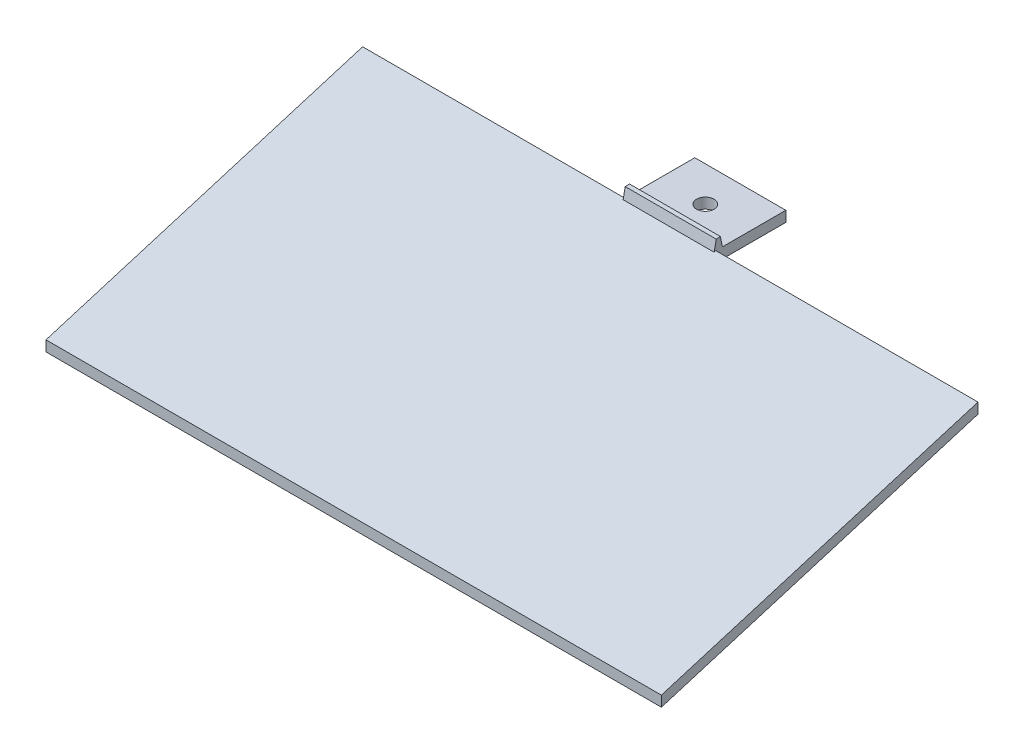
ISO-10303-21;
HEADER;
FILE_DESCRIPTION(('STEP AP214'),'2;1');
FILE_NAME('part.step','',(''),(''),'','','');
FILE_SCHEMA(('AUTOMOTIVE_DESIGN { 1 0 10303 214 1 1 1 1 }'));
ENDSEC;
DATA;
#1=APPLICATION_CONTEXT('core data for automotive mechanical design processes');
#2=APPLICATION_PROTOCOL_DEFINITION('international standard','automotive_design',2000,#1);
#3=PRODUCT_CONTEXT('',#1,'mechanical');
#4=PRODUCT('Part','Part','',(#3));
#5=PRODUCT_RELATED_PRODUCT_CATEGORY('part','',(#4));
#6=PRODUCT_DEFINITION_FORMATION('','',#4);
#7=PRODUCT_DEFINITION_CONTEXT('part definition',#1,'design');
#8=PRODUCT_DEFINITION('design','',#6,#7);
#9=PRODUCT_DEFINITION_SHAPE('','',#8);
#10=(LENGTH_UNIT() NAMED_UNIT(*) SI_UNIT(.MILLI.,.METRE.));
#11=(NAMED_UNIT(*) PLANE_ANGLE_UNIT() SI_UNIT($,.RADIAN.));
#12=(NAMED_UNIT(*) SI_UNIT($,.STERADIAN.) SOLID_ANGLE_UNIT());
#13=UNCERTAINTY_MEASURE_WITH_UNIT(LENGTH_MEASURE(1.E-05),#10,'distance_accuracy_value','');
#14=(GEOMETRIC_REPRESENTATION_CONTEXT(3) GLOBAL_UNCERTAINTY_ASSIGNED_CONTEXT((#13)) GLOBAL_UNIT_ASSIGNED_CONTEXT((#10,
#11,#12)) REPRESENTATION_CONTEXT('',''));
#15=CARTESIAN_POINT('',(0.,0.,0.));
#16=DIRECTION('',(0.,0.,1.));
#17=DIRECTION('',(1.,0.,0.));
#18=AXIS2_PLACEMENT_3D('',#15,#16,#17);
#19=CARTESIAN_POINT('',(175.8,27.7552587805887,8.37107196831925));
#20=DIRECTION('',(0.,-0.957402825925145,-0.288755656066761));
#21=DIRECTION('',(0.,0.288755656066761,-0.957402825925145));
#22=AXIS2_PLACEMENT_3D('',#19,#20,#21);
#23=PLANE('',#22);
#24=DIRECTION('',(0.,-0.288755656066761,0.957402825925145));
#25=VECTOR('',#24,1.);
#26=CARTESIAN_POINT('',(74.9,27.7552587805887,8.37107196831925));
#27=LINE('',#26,#25);
#28=CARTESIAN_POINT('',(74.9,30.28,0.));
#29=VERTEX_POINT('',#28);
#30=CARTESIAN_POINT('',(74.9,30.1336715689278,0.485168863287432));
#31=VERTEX_POINT('',#30);
#32=EDGE_CURVE('E147',#29,#31,#27,.T.);
#33=ORIENTED_EDGE('',*,*,#32,.F.);
#34=DIRECTION('',(1.,0.,0.));
#35=VECTOR('',#34,1.);
#36=CARTESIAN_POINT('',(0.,30.28,0.));
#37=LINE('',#36,#35);
#38=CARTESIAN_POINT('',(0.,30.28,0.));
#39=VERTEX_POINT('',#38);
#40=EDGE_CURVE('E176',#39,#29,#37,.T.);
#41=ORIENTED_EDGE('',*,*,#40,.F.);
#42=DIRECTION('',(0.,-0.288755656066761,0.957402825925145));
#43=VECTOR('',#42,1.);
#44=CARTESIAN_POINT('',(0.,27.7552587805887,8.37107196831925));
#45=LINE('',#44,#43);
#46=CARTESIAN_POINT('',(0.,2.99999999999937,90.45));
#47=VERTEX_POINT('',#46);
#48=EDGE_CURVE('E192',#39,#47,#45,.T.);
#49=ORIENTED_EDGE('',*,*,#48,.T.);
#50=DIRECTION('',(-1.,0.,0.));
#51=VECTOR('',#50,1.);
#52=CARTESIAN_POINT('',(175.8,2.99999999999937,90.45));
#53=LINE('',#52,#51);
#54=CARTESIAN_POINT('',(175.8,2.99999999999937,90.45));
#55=VERTEX_POINT('',#54);
#56=EDGE_CURVE('E218',#55,#47,#53,.T.);
#57=ORIENTED_EDGE('',*,*,#56,.F.);
#58=DIRECTION('',(0.,-0.288755656066761,0.957402825925145));
#59=VECTOR('',#58,1.);
#60=CARTESIAN_POINT('',(175.8,27.7552587805887,8.37107196831925));
#61=LINE('',#60,#59);
#62=CARTESIAN_POINT('',(175.8,30.28,0.));
#63=VERTEX_POINT('',#62);
#64=EDGE_CURVE('E196',#63,#55,#61,.T.);
#65=ORIENTED_EDGE('',*,*,#64,.F.);
#66=DIRECTION('',(-1.,0.,0.));
#67=VECTOR('',#66,1.);
#68=CARTESIAN_POINT('',(175.8,30.28,0.));
#69=LINE('',#68,#67);
#70=CARTESIAN_POINT('',(100.9,30.28,0.));
#71=VERTEX_POINT('',#70);
#72=EDGE_CURVE('E220',#63,#71,#69,.T.);
#73=ORIENTED_EDGE('',*,*,#72,.T.);
#74=DIRECTION('',(0.,-0.288755656066761,0.957402825925145));
#75=VECTOR('',#74,1.);
#76=CARTESIAN_POINT('',(100.9,27.7552587805887,8.37107196831925));
#77=LINE('',#76,#75);
#78=CARTESIAN_POINT('',(100.9,30.1336715689278,0.485168863287432));
#79=VERTEX_POINT('',#78);
#80=EDGE_CURVE('E152',#71,#79,#77,.T.);
#81=ORIENTED_EDGE('',*,*,#80,.T.);
#82=DIRECTION('',(-1.,0.,0.));
#83=VECTOR('',#82,1.);
#84=CARTESIAN_POINT('',(175.8,30.1336715689278,0.485168863287432));
#85=LINE('',#84,#83);
#86=EDGE_CURVE('E11',#79,#31,#85,.T.);
#87=ORIENTED_EDGE('',*,*,#86,.T.);
#88=EDGE_LOOP('',(#33,#41,#49,#57,#65,#73,#81,#87));
#89=FACE_BOUND('',#88,.T.);
#90=ADVANCED_FACE('F43',(#89),#23,.F.);
#91=CARTESIAN_POINT('',(0.,30.28,-20.));
#92=DIRECTION('',(0.,1.,0.));
#93=DIRECTION('',(0.,0.,1.));
#94=AXIS2_PLACEMENT_3D('',#91,#92,#93);
#95=PLANE('',#94);
#96=DIRECTION('',(1.,0.,0.));
#97=VECTOR('',#96,1.);
#98=CARTESIAN_POINT('',(74.9,30.28,-1.87837859176287));
#99=LINE('',#98,#97);
#100=CARTESIAN_POINT('',(74.9,30.28,-1.87837859176287));
#101=VERTEX_POINT('',#100);
#102=CARTESIAN_POINT('',(100.9,30.28,-1.87837859176287));
#103=VERTEX_POINT('',#102);
#104=EDGE_CURVE('E148',#101,#103,#99,.T.);
#105=ORIENTED_EDGE('',*,*,#104,.T.);
#106=DIRECTION('',(0.,0.,-1.));
#107=VECTOR('',#106,1.);
#108=CARTESIAN_POINT('',(100.9,30.28,0.));
#109=LINE('',#108,#107);
#110=CARTESIAN_POINT('',(100.9,30.28,-20.));
#111=VERTEX_POINT('',#110);
#112=EDGE_CURVE('E164',#103,#111,#109,.T.);
#113=ORIENTED_EDGE('',*,*,#112,.T.);
#114=DIRECTION('',(1.,0.,0.));
#115=VECTOR('',#114,1.);
#116=CARTESIAN_POINT('',(0.,30.28,-20.));
#117=LINE('',#116,#115);
#118=CARTESIAN_POINT('',(74.9,30.28,-20.));
#119=VERTEX_POINT('',#118);
#120=EDGE_CURVE('E189',#119,#111,#117,.T.);
#121=ORIENTED_EDGE('',*,*,#120,.F.);
#122=DIRECTION('',(0.,0.,-1.));
#123=VECTOR('',#122,1.);
#124=CARTESIAN_POINT('',(74.9,30.28,0.));
#125=LINE('',#124,#123);
#126=EDGE_CURVE('E179',#101,#119,#125,.T.);
#127=ORIENTED_EDGE('',*,*,#126,.F.);
#128=EDGE_LOOP('',(#105,#113,#121,#127));
#129=FACE_BOUND('',#128,.T.);
#130=CARTESIAN_POINT('',(87.9,30.28,-10.));
#131=DIRECTION('',(0.,1.,0.));
#132=DIRECTION('',(0.,0.,1.));
#133=AXIS2_PLACEMENT_3D('',#130,#131,#132);
#134=CIRCLE('',#133,2.5);
#135=CARTESIAN_POINT('',(87.9,30.28,-7.5));
#136=VERTEX_POINT('',#135);
#137=EDGE_CURVE('E163',#136,#136,#134,.T.);
#138=ORIENTED_EDGE('',*,*,#137,.F.);
#139=EDGE_LOOP('',(#138));
#140=FACE_BOUND('',#139,.T.);
#141=ADVANCED_FACE('F272',(#129,#140),#95,.T.);
#142=CARTESIAN_POINT('',(0.,27.28,-20.));
#143=DIRECTION('',(0.,0.,-1.));
#144=DIRECTION('',(-1.,0.,0.));
#145=AXIS2_PLACEMENT_3D('',#142,#143,#144);
#146=PLANE('',#145);
#147=ORIENTED_EDGE('',*,*,#120,.T.);
#148=DIRECTION('',(0.,1.,0.));
#149=VECTOR('',#148,1.);
#150=CARTESIAN_POINT('',(100.9,-135.52,-20.));
#151=LINE('',#150,#149);
#152=CARTESIAN_POINT('',(100.9,27.28,-20.));
#153=VERTEX_POINT('',#152);
#154=EDGE_CURVE('E168',#153,#111,#151,.T.);
#155=ORIENTED_EDGE('',*,*,#154,.F.);
#156=DIRECTION('',(1.,0.,0.));
#157=VECTOR('',#156,1.);
#158=CARTESIAN_POINT('',(0.,27.28,-20.));
#159=LINE('',#158,#157);
#160=CARTESIAN_POINT('',(74.9,27.28,-20.));
#161=VERTEX_POINT('',#160);
#162=EDGE_CURVE('E193',#161,#153,#159,.T.);
#163=ORIENTED_EDGE('',*,*,#162,.F.);
#164=DIRECTION('',(0.,1.,0.));
#165=VECTOR('',#164,1.);
#166=CARTESIAN_POINT('',(74.9,-135.52,-20.));
#167=LINE('',#166,#165);
#168=EDGE_CURVE('E183',#161,#119,#167,.T.);
#169=ORIENTED_EDGE('',*,*,#168,.T.);
#170=EDGE_LOOP('',(#147,#155,#163,#169));
#171=FACE_BOUND('',#170,.T.);
#172=ADVANCED_FACE('F276',(#171),#146,.T.);
#173=CARTESIAN_POINT('',(0.,27.28,0.));
#174=DIRECTION('',(0.,-1.,0.));
#175=DIRECTION('',(0.,0.,-1.));
#176=AXIS2_PLACEMENT_3D('',#173,#174,#175);
#177=PLANE('',#176);
#178=CARTESIAN_POINT('',(87.9,27.28,-10.));
#179=DIRECTION('',(0.,-1.,0.));
#180=DIRECTION('',(0.,0.,-1.));
#181=AXIS2_PLACEMENT_3D('',#178,#179,#180);
#182=CIRCLE('',#181,2.5);
#183=CARTESIAN_POINT('',(87.9,27.28,-12.5));
#184=VERTEX_POINT('',#183);
#185=EDGE_CURVE('E171',#184,#184,#182,.T.);
#186=ORIENTED_EDGE('',*,*,#185,.F.);
#187=EDGE_LOOP('',(#186));
#188=FACE_BOUND('',#187,.T.);
#189=ORIENTED_EDGE('',*,*,#162,.T.);
#190=DIRECTION('',(0.,0.,1.));
#191=VECTOR('',#190,1.);
#192=CARTESIAN_POINT('',(100.9,27.28,0.));
#193=LINE('',#192,#191);
#194=CARTESIAN_POINT('',(100.9,27.28,0.));
#195=VERTEX_POINT('',#194);
#196=EDGE_CURVE('E50',#153,#195,#193,.T.);
#197=ORIENTED_EDGE('',*,*,#196,.T.);
#198=DIRECTION('',(-1.,0.,0.));
#199=VECTOR('',#198,1.);
#200=CARTESIAN_POINT('',(175.8,27.28,0.));
#201=LINE('',#200,#199);
#202=CARTESIAN_POINT('',(74.9,27.28,0.));
#203=VERTEX_POINT('',#202);
#204=EDGE_CURVE('E216',#195,#203,#201,.T.);
#205=ORIENTED_EDGE('',*,*,#204,.T.);
#206=DIRECTION('',(0.,0.,1.));
#207=VECTOR('',#206,1.);
#208=CARTESIAN_POINT('',(74.9,27.28,0.));
#209=LINE('',#208,#207);
#210=EDGE_CURVE('E223',#161,#203,#209,.T.);
#211=ORIENTED_EDGE('',*,*,#210,.F.);
#212=EDGE_LOOP('',(#189,#197,#205,#211));
#213=FACE_BOUND('',#212,.T.);
#214=ADVANCED_FACE('F230',(#188,#213),#177,.T.);
#215=CARTESIAN_POINT('',(175.8,0.,90.45));
#216=DIRECTION('',(0.,0.,1.));
#217=DIRECTION('',(1.,0.,0.));
#218=AXIS2_PLACEMENT_3D('',#215,#216,#217);
#219=PLANE('',#218);
#220=DIRECTION('',(0.,1.,0.));
#221=VECTOR('',#220,1.);
#222=CARTESIAN_POINT('',(0.,0.,90.45));
#223=LINE('',#222,#221);
#224=CARTESIAN_POINT('',(0.,-6.31406483018309E-13,90.45));
#225=VERTEX_POINT('',#224);
#226=EDGE_CURVE('E208',#225,#47,#223,.T.);
#227=ORIENTED_EDGE('',*,*,#226,.F.);
#228=DIRECTION('',(-1.,0.,0.));
#229=VECTOR('',#228,1.);
#230=CARTESIAN_POINT('',(175.8,-6.31406483018309E-13,90.45));
#231=LINE('',#230,#229);
#232=CARTESIAN_POINT('',(175.8,-6.31406483018309E-13,90.45));
#233=VERTEX_POINT('',#232);
#234=EDGE_CURVE('E215',#233,#225,#231,.T.);
#235=ORIENTED_EDGE('',*,*,#234,.F.);
#236=DIRECTION('',(0.,1.,0.));
#237=VECTOR('',#236,1.);
#238=CARTESIAN_POINT('',(175.8,0.,90.45));
#239=LINE('',#238,#237);
#240=EDGE_CURVE('E198',#233,#55,#239,.T.);
#241=ORIENTED_EDGE('',*,*,#240,.T.);
#242=ORIENTED_EDGE('',*,*,#56,.T.);
#243=EDGE_LOOP('',(#227,#235,#241,#242));
#244=FACE_BOUND('',#243,.T.);
#245=ADVANCED_FACE('F252',(#244),#219,.T.);
#246=CARTESIAN_POINT('',(175.8,25.0053982673203,7.5417055249587));
#247=DIRECTION('',(0.,0.957402825925145,0.288755656066761));
#248=DIRECTION('',(0.,-0.288755656066761,0.957402825925145));
#249=AXIS2_PLACEMENT_3D('',#246,#247,#248);
#250=PLANE('',#249);
#251=DIRECTION('',(0.,0.288755656066761,-0.957402825925145));
#252=VECTOR('',#251,1.);
#253=CARTESIAN_POINT('',(0.,25.0053982673203,7.5417055249587));
#254=LINE('',#253,#252);
#255=CARTESIAN_POINT('',(0.,27.28,0.));
#256=VERTEX_POINT('',#255);
#257=EDGE_CURVE('E199',#225,#256,#254,.T.);
#258=ORIENTED_EDGE('',*,*,#257,.T.);
#259=EDGE_CURVE('E205',#203,#256,#201,.T.);
#260=ORIENTED_EDGE('',*,*,#259,.F.);
#261=ORIENTED_EDGE('',*,*,#204,.F.);
#262=CARTESIAN_POINT('',(175.8,27.28,0.));
#263=VERTEX_POINT('',#262);
#264=EDGE_CURVE('E213',#263,#195,#201,.T.);
#265=ORIENTED_EDGE('',*,*,#264,.F.);
#266=DIRECTION('',(0.,0.288755656066761,-0.957402825925145));
#267=VECTOR('',#266,1.);
#268=CARTESIAN_POINT('',(175.8,25.0053982673203,7.5417055249587));
#269=LINE('',#268,#267);
#270=EDGE_CURVE('E202',#233,#263,#269,.T.);
#271=ORIENTED_EDGE('',*,*,#270,.F.);
#272=ORIENTED_EDGE('',*,*,#234,.T.);
#273=EDGE_LOOP('',(#258,#260,#261,#265,#271,#272));
#274=FACE_BOUND('',#273,.T.);
#275=ADVANCED_FACE('F238',(#274),#250,.F.);
#276=CARTESIAN_POINT('',(175.8,0.,0.));
#277=DIRECTION('',(1.,0.,0.));
#278=DIRECTION('',(0.,0.,-1.));
#279=AXIS2_PLACEMENT_3D('',#276,#277,#278);
#280=PLANE('',#279);
#281=DIRECTION('',(0.,1.,0.));
#282=VECTOR('',#281,1.);
#283=CARTESIAN_POINT('',(175.8,-135.52,0.));
#284=LINE('',#283,#282);
#285=EDGE_CURVE('E172',#263,#63,#284,.T.);
#286=ORIENTED_EDGE('',*,*,#285,.T.);
#287=ORIENTED_EDGE('',*,*,#64,.T.);
#288=ORIENTED_EDGE('',*,*,#240,.F.);
#289=ORIENTED_EDGE('',*,*,#270,.T.);
#290=EDGE_LOOP('',(#286,#287,#288,#289));
#291=FACE_BOUND('',#290,.T.);
#292=ADVANCED_FACE('F260',(#291),#280,.T.);
#293=CARTESIAN_POINT('',(0.,0.,0.));
#294=DIRECTION('',(1.,0.,0.));
#295=DIRECTION('',(0.,0.,-1.));
#296=AXIS2_PLACEMENT_3D('',#293,#294,#295);
#297=PLANE('',#296);
#298=ORIENTED_EDGE('',*,*,#48,.F.);
#299=DIRECTION('',(0.,1.,0.));
#300=VECTOR('',#299,1.);
#301=CARTESIAN_POINT('',(0.,-135.52,0.));
#302=LINE('',#301,#300);
#303=EDGE_CURVE('E167',#256,#39,#302,.T.);
#304=ORIENTED_EDGE('',*,*,#303,.F.);
#305=ORIENTED_EDGE('',*,*,#257,.F.);
#306=ORIENTED_EDGE('',*,*,#226,.T.);
#307=EDGE_LOOP('',(#298,#304,#305,#306));
#308=FACE_BOUND('',#307,.T.);
#309=ADVANCED_FACE('F248',(#308),#297,.F.);
#310=CARTESIAN_POINT('',(87.9,-135.52,-10.));
#311=DIRECTION('',(0.,1.,0.));
#312=DIRECTION('',(0.,0.,1.));
#313=AXIS2_PLACEMENT_3D('',#310,#311,#312);
#314=CYLINDRICAL_SURFACE('',#313,2.5);
#315=ORIENTED_EDGE('',*,*,#185,.T.);
#316=EDGE_LOOP('',(#315));
#317=FACE_BOUND('',#316,.T.);
#318=ORIENTED_EDGE('',*,*,#137,.T.);
#319=EDGE_LOOP('',(#318));
#320=FACE_BOUND('',#319,.T.);
#321=ADVANCED_FACE('F267',(#317,#320),#314,.F.);
#322=CARTESIAN_POINT('',(0.,-135.52,0.));
#323=DIRECTION('',(0.,0.,1.));
#324=DIRECTION('',(1.,0.,0.));
#325=AXIS2_PLACEMENT_3D('',#322,#323,#324);
#326=PLANE('',#325);
#327=ORIENTED_EDGE('',*,*,#259,.T.);
#328=ORIENTED_EDGE('',*,*,#303,.T.);
#329=ORIENTED_EDGE('',*,*,#40,.T.);
#330=DIRECTION('',(0.,1.,0.));
#331=VECTOR('',#330,1.);
#332=CARTESIAN_POINT('',(74.9,-135.52,0.));
#333=LINE('',#332,#331);
#334=EDGE_CURVE('E181',#203,#29,#333,.T.);
#335=ORIENTED_EDGE('',*,*,#334,.F.);
#336=EDGE_LOOP('',(#327,#328,#329,#335));
#337=FACE_BOUND('',#336,.T.);
#338=ADVANCED_FACE('F243',(#337),#326,.F.);
#339=CARTESIAN_POINT('',(74.9,-135.52,0.));
#340=DIRECTION('',(1.,0.,0.));
#341=DIRECTION('',(0.,0.,-1.));
#342=AXIS2_PLACEMENT_3D('',#339,#340,#341);
#343=PLANE('',#342);
#344=DIRECTION('',(0.,-0.978684695766624,0.205368610727613));
#345=VECTOR('',#344,1.);
#346=CARTESIAN_POINT('',(74.9,36.0003996602827,-0.745913836636095));
#347=LINE('',#346,#345);
#348=CARTESIAN_POINT('',(74.9,33.0670356146052,-0.130372486674332));
#349=VERTEX_POINT('',#348);
#350=EDGE_CURVE('E142',#349,#31,#347,.T.);
#351=ORIENTED_EDGE('',*,*,#350,.F.);
#352=DIRECTION('',(0.,0.0617922023912827,-0.998089035970055));
#353=VECTOR('',#352,1.);
#354=CARTESIAN_POINT('',(74.9,33.0670356146052,-0.130372486674332));
#355=LINE('',#354,#353);
#356=CARTESIAN_POINT('',(74.9,33.1401998301413,-1.31214621419949));
#357=VERTEX_POINT('',#356);
#358=EDGE_CURVE('E130',#349,#357,#355,.T.);
#359=ORIENTED_EDGE('',*,*,#358,.T.);
#360=DIRECTION('',(0.,0.980961848956318,0.194200542976072));
#361=VECTOR('',#360,1.);
#362=CARTESIAN_POINT('',(74.9,30.28,-1.87837859176287));
#363=LINE('',#362,#361);
#364=EDGE_CURVE('E149',#101,#357,#363,.T.);
#365=ORIENTED_EDGE('',*,*,#364,.F.);
#366=ORIENTED_EDGE('',*,*,#126,.T.);
#367=ORIENTED_EDGE('',*,*,#168,.F.);
#368=ORIENTED_EDGE('',*,*,#210,.T.);
#369=ORIENTED_EDGE('',*,*,#334,.T.);
#370=ORIENTED_EDGE('',*,*,#32,.T.);
#371=EDGE_LOOP('',(#351,#359,#365,#366,#367,#368,#369,#370));
#372=FACE_BOUND('',#371,.T.);
#373=ADVANCED_FACE('F145',(#372),#343,.F.);
#374=CARTESIAN_POINT('',(100.9,-135.52,0.));
#375=DIRECTION('',(1.,0.,0.));
#376=DIRECTION('',(0.,0.,-1.));
#377=AXIS2_PLACEMENT_3D('',#374,#375,#376);
#378=PLANE('',#377);
#379=DIRECTION('',(0.,0.0617922023912827,-0.998089035970055));
#380=VECTOR('',#379,1.);
#381=CARTESIAN_POINT('',(100.9,33.0670356146052,-0.130372486674332));
#382=LINE('',#381,#380);
#383=CARTESIAN_POINT('',(100.9,33.0670356146052,-0.130372486674332));
#384=VERTEX_POINT('',#383);
#385=CARTESIAN_POINT('',(100.9,33.1401998301413,-1.31214621419949));
#386=VERTEX_POINT('',#385);
#387=EDGE_CURVE('E57',#384,#386,#382,.T.);
#388=ORIENTED_EDGE('',*,*,#387,.F.);
#389=DIRECTION('',(0.,-0.978684695766624,0.205368610727613));
#390=VECTOR('',#389,1.);
#391=CARTESIAN_POINT('',(100.9,36.0003996602827,-0.745913836636095));
#392=LINE('',#391,#390);
#393=EDGE_CURVE('E64',#384,#79,#392,.T.);
#394=ORIENTED_EDGE('',*,*,#393,.T.);
#395=ORIENTED_EDGE('',*,*,#80,.F.);
#396=DIRECTION('',(0.,1.,0.));
#397=VECTOR('',#396,1.);
#398=CARTESIAN_POINT('',(100.9,-135.52,0.));
#399=LINE('',#398,#397);
#400=EDGE_CURVE('E166',#195,#71,#399,.T.);
#401=ORIENTED_EDGE('',*,*,#400,.F.);
#402=ORIENTED_EDGE('',*,*,#196,.F.);
#403=ORIENTED_EDGE('',*,*,#154,.T.);
#404=ORIENTED_EDGE('',*,*,#112,.F.);
#405=DIRECTION('',(0.,0.980961848956318,0.194200542976072));
#406=VECTOR('',#405,1.);
#407=CARTESIAN_POINT('',(100.9,30.28,-1.87837859176287));
#408=LINE('',#407,#406);
#409=EDGE_CURVE('E156',#103,#386,#408,.T.);
#410=ORIENTED_EDGE('',*,*,#409,.T.);
#411=EDGE_LOOP('',(#388,#394,#395,#401,#402,#403,#404,#410));
#412=FACE_BOUND('',#411,.T.);
#413=ADVANCED_FACE('F256',(#412),#378,.T.);
#414=CARTESIAN_POINT('',(0.,-135.52,0.));
#415=DIRECTION('',(0.,0.,1.));
#416=DIRECTION('',(1.,0.,0.));
#417=AXIS2_PLACEMENT_3D('',#414,#415,#416);
#418=PLANE('',#417);
#419=ORIENTED_EDGE('',*,*,#264,.T.);
#420=ORIENTED_EDGE('',*,*,#400,.T.);
#421=ORIENTED_EDGE('',*,*,#72,.F.);
#422=ORIENTED_EDGE('',*,*,#285,.F.);
#423=EDGE_LOOP('',(#419,#420,#421,#422));
#424=FACE_BOUND('',#423,.T.);
#425=ADVANCED_FACE('F258',(#424),#418,.F.);
#426=CARTESIAN_POINT('',(74.9,36.0003996602827,-0.745913836636095));
#427=DIRECTION('',(0.,0.205368610727613,0.978684695766624));
#428=DIRECTION('',(0.,-0.978684695766624,0.205368610727613));
#429=AXIS2_PLACEMENT_3D('',#426,#427,#428);
#430=PLANE('',#429);
#431=DIRECTION('',(1.,0.,0.));
#432=VECTOR('',#431,1.);
#433=CARTESIAN_POINT('',(74.9,33.0670356146052,-0.130372486674332));
#434=LINE('',#433,#432);
#435=EDGE_CURVE('E133',#349,#384,#434,.T.);
#436=ORIENTED_EDGE('',*,*,#435,.F.);
#437=ORIENTED_EDGE('',*,*,#350,.T.);
#438=ORIENTED_EDGE('',*,*,#86,.F.);
#439=ORIENTED_EDGE('',*,*,#393,.F.);
#440=EDGE_LOOP('',(#436,#437,#438,#439));
#441=FACE_BOUND('',#440,.T.);
#442=ADVANCED_FACE('F141',(#441),#430,.T.);
#443=CARTESIAN_POINT('',(74.9,30.28,-1.87837859176287));
#444=DIRECTION('',(0.,0.194200542976072,-0.980961848956318));
#445=DIRECTION('',(0.,0.980961848956319,0.194200542976072));
#446=AXIS2_PLACEMENT_3D('',#443,#444,#445);
#447=PLANE('',#446);
#448=DIRECTION('',(1.,0.,0.));
#449=VECTOR('',#448,1.);
#450=CARTESIAN_POINT('',(74.9,33.1401998301413,-1.31214621419949));
#451=LINE('',#450,#449);
#452=EDGE_CURVE('E134',#357,#386,#451,.T.);
#453=ORIENTED_EDGE('',*,*,#452,.T.);
#454=ORIENTED_EDGE('',*,*,#409,.F.);
#455=ORIENTED_EDGE('',*,*,#104,.F.);
#456=ORIENTED_EDGE('',*,*,#364,.T.);
#457=EDGE_LOOP('',(#453,#454,#455,#456));
#458=FACE_BOUND('',#457,.T.);
#459=ADVANCED_FACE('F309',(#458),#447,.T.);
#460=CARTESIAN_POINT('',(74.9,33.0670356146052,-0.130372486674332));
#461=DIRECTION('',(0.,-0.998089035970056,-0.0617922023912827));
#462=DIRECTION('',(0.,0.0617922023912827,-0.998089035970056));
#463=AXIS2_PLACEMENT_3D('',#460,#461,#462);
#464=PLANE('',#463);
#465=ORIENTED_EDGE('',*,*,#387,.T.);
#466=ORIENTED_EDGE('',*,*,#452,.F.);
#467=ORIENTED_EDGE('',*,*,#358,.F.);
#468=ORIENTED_EDGE('',*,*,#435,.T.);
#469=EDGE_LOOP('',(#465,#466,#467,#468));
#470=FACE_BOUND('',#469,.T.);
#471=ADVANCED_FACE('F132',(#470),#464,.F.);
#472=CLOSED_SHELL('',(#90,#141,#172,#214,#245,#275,#292,#309,#321,#338,#373,#413,#425,#442,#459,#471));
#473=MANIFOLD_SOLID_BREP('B2',#472);
#474=ADVANCED_BREP_SHAPE_REPRESENTATION('',(#18,#473),#14);
#475=SHAPE_DEFINITION_REPRESENTATION(#9,#474);
ENDSEC;
END-ISO-10303-21;
